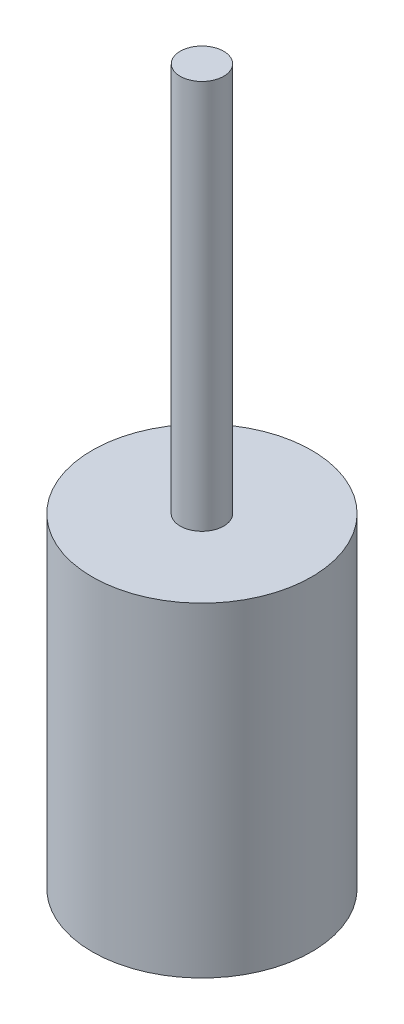
ISO-10303-21;
HEADER;
FILE_DESCRIPTION(('STEP AP214'),'2;1');
FILE_NAME('part.step','',(''),(''),'','','');
FILE_SCHEMA(('AUTOMOTIVE_DESIGN { 1 0 10303 214 1 1 1 1 }'));
ENDSEC;
DATA;
#1=APPLICATION_CONTEXT('core data for automotive mechanical design processes');
#2=APPLICATION_PROTOCOL_DEFINITION('international standard','automotive_design',2000,#1);
#3=PRODUCT_CONTEXT('',#1,'mechanical');
#4=PRODUCT('Part','Part','',(#3));
#5=PRODUCT_RELATED_PRODUCT_CATEGORY('part','',(#4));
#6=PRODUCT_DEFINITION_FORMATION('','',#4);
#7=PRODUCT_DEFINITION_CONTEXT('part definition',#1,'design');
#8=PRODUCT_DEFINITION('design','',#6,#7);
#9=PRODUCT_DEFINITION_SHAPE('','',#8);
#10=(LENGTH_UNIT() NAMED_UNIT(*) SI_UNIT(.MILLI.,.METRE.));
#11=(NAMED_UNIT(*) PLANE_ANGLE_UNIT() SI_UNIT($,.RADIAN.));
#12=(NAMED_UNIT(*) SI_UNIT($,.STERADIAN.) SOLID_ANGLE_UNIT());
#13=UNCERTAINTY_MEASURE_WITH_UNIT(LENGTH_MEASURE(1.E-05),#10,'distance_accuracy_value','');
#14=(GEOMETRIC_REPRESENTATION_CONTEXT(3) GLOBAL_UNCERTAINTY_ASSIGNED_CONTEXT((#13)) GLOBAL_UNIT_ASSIGNED_CONTEXT((#10,
#11,#12)) REPRESENTATION_CONTEXT('',''));
#15=CARTESIAN_POINT('',(0.,0.,0.));
#16=DIRECTION('',(0.,0.,1.));
#17=DIRECTION('',(1.,0.,0.));
#18=AXIS2_PLACEMENT_3D('',#15,#16,#17);
#19=CARTESIAN_POINT('',(0.,63.5,0.));
#20=DIRECTION('',(0.,-1.,0.));
#21=DIRECTION('',(0.,0.,-1.));
#22=AXIS2_PLACEMENT_3D('',#19,#20,#21);
#23=CYLINDRICAL_SURFACE('',#22,21.463);
#24=CARTESIAN_POINT('',(0.,63.5,0.));
#25=DIRECTION('',(0.,1.,0.));
#26=DIRECTION('',(0.,0.,1.));
#27=AXIS2_PLACEMENT_3D('',#24,#25,#26);
#28=CIRCLE('',#27,21.463);
#29=CARTESIAN_POINT('',(0.,63.5,21.463));
#30=VERTEX_POINT('',#29);
#31=EDGE_CURVE('E49',#30,#30,#28,.T.);
#32=ORIENTED_EDGE('',*,*,#31,.F.);
#33=EDGE_LOOP('',(#32));
#34=FACE_BOUND('',#33,.T.);
#35=CARTESIAN_POINT('',(0.,0.,0.));
#36=DIRECTION('',(0.,1.,0.));
#37=DIRECTION('',(0.,0.,1.));
#38=AXIS2_PLACEMENT_3D('',#35,#36,#37);
#39=CIRCLE('',#38,21.463);
#40=CARTESIAN_POINT('',(0.,0.,21.463));
#41=VERTEX_POINT('',#40);
#42=EDGE_CURVE('E44',#41,#41,#39,.T.);
#43=ORIENTED_EDGE('',*,*,#42,.T.);
#44=EDGE_LOOP('',(#43));
#45=FACE_BOUND('',#44,.T.);
#46=ADVANCED_FACE('F41',(#34,#45),#23,.T.);
#47=CARTESIAN_POINT('',(0.,63.5,0.));
#48=DIRECTION('',(0.,1.,0.));
#49=DIRECTION('',(0.,0.,1.));
#50=AXIS2_PLACEMENT_3D('',#47,#48,#49);
#51=PLANE('',#50);
#52=CARTESIAN_POINT('',(0.,63.5,0.));
#53=DIRECTION('',(0.,1.,0.));
#54=DIRECTION('',(0.,0.,1.));
#55=AXIS2_PLACEMENT_3D('',#52,#53,#54);
#56=CIRCLE('',#55,4.25);
#57=CARTESIAN_POINT('',(0.,63.5,4.25));
#58=VERTEX_POINT('',#57);
#59=EDGE_CURVE('E10',#58,#58,#56,.T.);
#60=ORIENTED_EDGE('',*,*,#59,.F.);
#61=EDGE_LOOP('',(#60));
#62=FACE_BOUND('',#61,.T.);
#63=ORIENTED_EDGE('',*,*,#31,.T.);
#64=EDGE_LOOP('',(#63));
#65=FACE_BOUND('',#64,.T.);
#66=ADVANCED_FACE('F69',(#62,#65),#51,.T.);
#67=CARTESIAN_POINT('',(0.,0.,0.));
#68=DIRECTION('',(0.,1.,0.));
#69=DIRECTION('',(0.,0.,1.));
#70=AXIS2_PLACEMENT_3D('',#67,#68,#69);
#71=PLANE('',#70);
#72=ORIENTED_EDGE('',*,*,#42,.F.);
#73=EDGE_LOOP('',(#72));
#74=FACE_BOUND('',#73,.T.);
#75=ADVANCED_FACE('F66',(#74),#71,.F.);
#76=CARTESIAN_POINT('',(0.,139.7,0.));
#77=DIRECTION('',(0.,-1.,0.));
#78=DIRECTION('',(0.,0.,-1.));
#79=AXIS2_PLACEMENT_3D('',#76,#77,#78);
#80=CYLINDRICAL_SURFACE('',#79,4.25);
#81=CARTESIAN_POINT('',(0.,139.7,0.));
#82=DIRECTION('',(0.,1.,0.));
#83=DIRECTION('',(0.,0.,1.));
#84=AXIS2_PLACEMENT_3D('',#81,#82,#83);
#85=CIRCLE('',#84,4.25);
#86=CARTESIAN_POINT('',(0.,139.7,4.25));
#87=VERTEX_POINT('',#86);
#88=EDGE_CURVE('E56',#87,#87,#85,.T.);
#89=ORIENTED_EDGE('',*,*,#88,.F.);
#90=EDGE_LOOP('',(#89));
#91=FACE_BOUND('',#90,.T.);
#92=ORIENTED_EDGE('',*,*,#59,.T.);
#93=EDGE_LOOP('',(#92));
#94=FACE_BOUND('',#93,.T.);
#95=ADVANCED_FACE('F68',(#91,#94),#80,.T.);
#96=CARTESIAN_POINT('',(0.,139.7,0.));
#97=DIRECTION('',(0.,1.,0.));
#98=DIRECTION('',(0.,0.,1.));
#99=AXIS2_PLACEMENT_3D('',#96,#97,#98);
#100=PLANE('',#99);
#101=ORIENTED_EDGE('',*,*,#88,.T.);
#102=EDGE_LOOP('',(#101));
#103=FACE_BOUND('',#102,.T.);
#104=ADVANCED_FACE('F74',(#103),#100,.T.);
#105=CLOSED_SHELL('',(#46,#66,#75,#95,#104));
#106=MANIFOLD_SOLID_BREP('B2',#105);
#107=ADVANCED_BREP_SHAPE_REPRESENTATION('',(#18,#106),#14);
#108=SHAPE_DEFINITION_REPRESENTATION(#9,#107);
ENDSEC;
END-ISO-10303-21;
